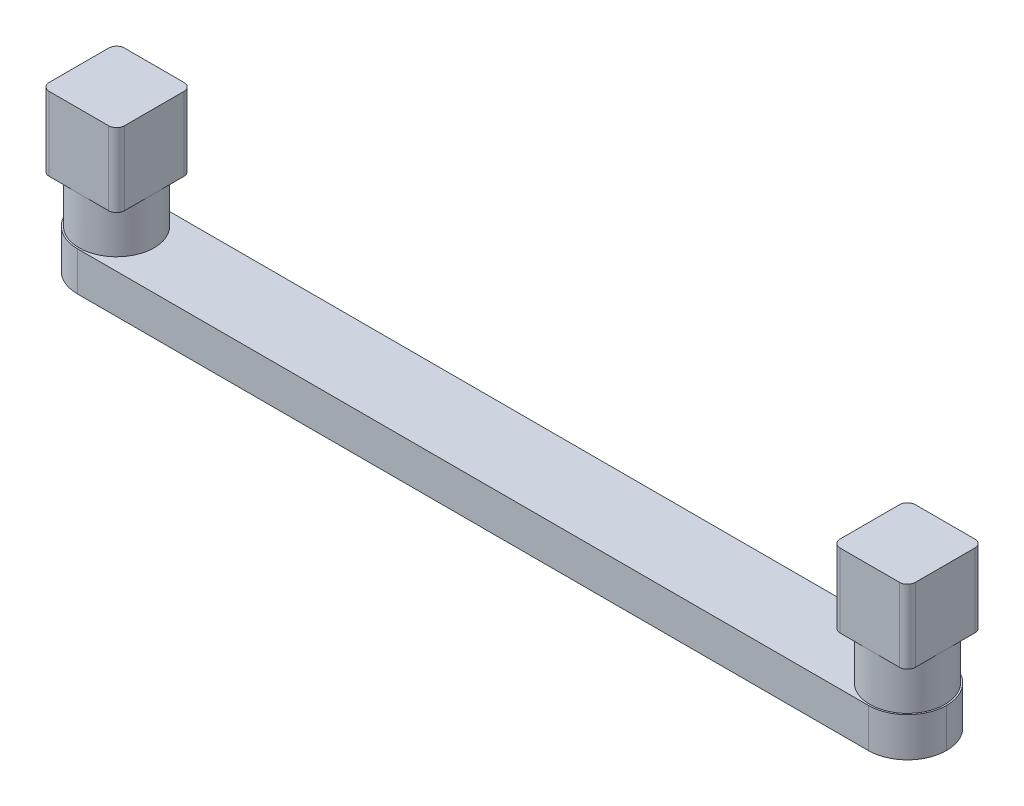
ISO-10303-21;
HEADER;
FILE_DESCRIPTION(('STEP AP214'),'2;1');
FILE_NAME('part.step','',(''),(''),'','','');
FILE_SCHEMA(('AUTOMOTIVE_DESIGN { 1 0 10303 214 1 1 1 1 }'));
ENDSEC;
DATA;
#1=APPLICATION_CONTEXT('core data for automotive mechanical design processes');
#2=APPLICATION_PROTOCOL_DEFINITION('international standard','automotive_design',2000,#1);
#3=PRODUCT_CONTEXT('',#1,'mechanical');
#4=PRODUCT('Part','Part','',(#3));
#5=PRODUCT_RELATED_PRODUCT_CATEGORY('part','',(#4));
#6=PRODUCT_DEFINITION_FORMATION('','',#4);
#7=PRODUCT_DEFINITION_CONTEXT('part definition',#1,'design');
#8=PRODUCT_DEFINITION('design','',#6,#7);
#9=PRODUCT_DEFINITION_SHAPE('','',#8);
#10=(LENGTH_UNIT() NAMED_UNIT(*) SI_UNIT(.MILLI.,.METRE.));
#11=(NAMED_UNIT(*) PLANE_ANGLE_UNIT() SI_UNIT($,.RADIAN.));
#12=(NAMED_UNIT(*) SI_UNIT($,.STERADIAN.) SOLID_ANGLE_UNIT());
#13=UNCERTAINTY_MEASURE_WITH_UNIT(LENGTH_MEASURE(1.E-05),#10,'distance_accuracy_value','');
#14=(GEOMETRIC_REPRESENTATION_CONTEXT(3) GLOBAL_UNCERTAINTY_ASSIGNED_CONTEXT((#13)) GLOBAL_UNIT_ASSIGNED_CONTEXT((#10,
#11,#12)) REPRESENTATION_CONTEXT('',''));
#15=CARTESIAN_POINT('',(0.,0.,0.));
#16=DIRECTION('',(0.,0.,1.));
#17=DIRECTION('',(1.,0.,0.));
#18=AXIS2_PLACEMENT_3D('',#15,#16,#17);
#19=CARTESIAN_POINT('',(-35.2425,3.175,-3.175));
#20=DIRECTION('',(0.,0.,1.));
#21=DIRECTION('',(1.,0.,0.));
#22=AXIS2_PLACEMENT_3D('',#19,#20,#21);
#23=PLANE('',#22);
#24=DIRECTION('',(-1.,0.,0.));
#25=VECTOR('',#24,1.);
#26=CARTESIAN_POINT('',(-35.2425,0.,-3.175));
#27=LINE('',#26,#25);
#28=CARTESIAN_POINT('',(32.0675,0.,-3.175));
#29=VERTEX_POINT('',#28);
#30=CARTESIAN_POINT('',(-32.0675,0.,-3.175));
#31=VERTEX_POINT('',#30);
#32=EDGE_CURVE('E281',#29,#31,#27,.T.);
#33=ORIENTED_EDGE('',*,*,#32,.T.);
#34=DIRECTION('',(0.,-1.,0.));
#35=VECTOR('',#34,1.);
#36=CARTESIAN_POINT('',(-32.0675,3.175,-3.175));
#37=LINE('',#36,#35);
#38=CARTESIAN_POINT('',(-32.0675,3.175,-3.175));
#39=VERTEX_POINT('',#38);
#40=EDGE_CURVE('E321',#31,#39,#37,.F.);
#41=ORIENTED_EDGE('',*,*,#40,.T.);
#42=DIRECTION('',(-1.,0.,0.));
#43=VECTOR('',#42,1.);
#44=CARTESIAN_POINT('',(-35.2425,3.175,-3.175));
#45=LINE('',#44,#43);
#46=CARTESIAN_POINT('',(32.0675,3.175,-3.175));
#47=VERTEX_POINT('',#46);
#48=EDGE_CURVE('E283',#47,#39,#45,.T.);
#49=ORIENTED_EDGE('',*,*,#48,.F.);
#50=DIRECTION('',(0.,-1.,0.));
#51=VECTOR('',#50,1.);
#52=CARTESIAN_POINT('',(32.0675,3.175,-3.175));
#53=LINE('',#52,#51);
#54=EDGE_CURVE('E319',#47,#29,#53,.T.);
#55=ORIENTED_EDGE('',*,*,#54,.T.);
#56=EDGE_LOOP('',(#33,#41,#49,#55));
#57=FACE_BOUND('',#56,.T.);
#58=ADVANCED_FACE('F35',(#57),#23,.F.);
#59=CARTESIAN_POINT('',(-35.2425,3.175,3.175));
#60=DIRECTION('',(0.,0.,-1.));
#61=DIRECTION('',(-1.,0.,0.));
#62=AXIS2_PLACEMENT_3D('',#59,#60,#61);
#63=PLANE('',#62);
#64=DIRECTION('',(1.,0.,0.));
#65=VECTOR('',#64,1.);
#66=CARTESIAN_POINT('',(-35.2425,3.175,3.175));
#67=LINE('',#66,#65);
#68=CARTESIAN_POINT('',(-32.0675,3.175,3.175));
#69=VERTEX_POINT('',#68);
#70=CARTESIAN_POINT('',(32.0675,3.175,3.175));
#71=VERTEX_POINT('',#70);
#72=EDGE_CURVE('E286',#69,#71,#67,.T.);
#73=ORIENTED_EDGE('',*,*,#72,.F.);
#74=DIRECTION('',(0.,-1.,0.));
#75=VECTOR('',#74,1.);
#76=CARTESIAN_POINT('',(-32.0675,3.175,3.175));
#77=LINE('',#76,#75);
#78=CARTESIAN_POINT('',(-32.0675,0.,3.175));
#79=VERTEX_POINT('',#78);
#80=EDGE_CURVE('E300',#69,#79,#77,.T.);
#81=ORIENTED_EDGE('',*,*,#80,.T.);
#82=DIRECTION('',(1.,0.,0.));
#83=VECTOR('',#82,1.);
#84=CARTESIAN_POINT('',(-35.2425,0.,3.175));
#85=LINE('',#84,#83);
#86=CARTESIAN_POINT('',(32.0675,0.,3.175));
#87=VERTEX_POINT('',#86);
#88=EDGE_CURVE('E287',#79,#87,#85,.T.);
#89=ORIENTED_EDGE('',*,*,#88,.T.);
#90=DIRECTION('',(0.,-1.,0.));
#91=VECTOR('',#90,1.);
#92=CARTESIAN_POINT('',(32.0675,3.175,3.175));
#93=LINE('',#92,#91);
#94=EDGE_CURVE('E297',#87,#71,#93,.F.);
#95=ORIENTED_EDGE('',*,*,#94,.T.);
#96=EDGE_LOOP('',(#73,#81,#89,#95));
#97=FACE_BOUND('',#96,.T.);
#98=ADVANCED_FACE('F449',(#97),#63,.F.);
#99=CARTESIAN_POINT('',(0.,3.175,0.));
#100=DIRECTION('',(0.,-1.,0.));
#101=DIRECTION('',(0.,0.,-1.));
#102=AXIS2_PLACEMENT_3D('',#99,#100,#101);
#103=PLANE('',#102);
#104=CARTESIAN_POINT('',(-32.0675,3.175,0.));
#105=DIRECTION('',(0.,-1.,0.));
#106=DIRECTION('',(0.,0.,1.));
#107=AXIS2_PLACEMENT_3D('',#104,#105,#106);
#108=CIRCLE('',#107,3.048);
#109=CARTESIAN_POINT('',(-32.0675,3.175,3.048));
#110=VERTEX_POINT('',#109);
#111=EDGE_CURVE('E244',#110,#110,#108,.T.);
#112=ORIENTED_EDGE('',*,*,#111,.T.);
#113=EDGE_LOOP('',(#112));
#114=FACE_BOUND('',#113,.T.);
#115=CARTESIAN_POINT('',(32.0675,3.175,0.));
#116=DIRECTION('',(0.,-1.,0.));
#117=DIRECTION('',(0.,0.,-1.));
#118=AXIS2_PLACEMENT_3D('',#115,#116,#117);
#119=CIRCLE('',#118,3.048);
#120=CARTESIAN_POINT('',(32.0675,3.175,-3.048));
#121=VERTEX_POINT('',#120);
#122=EDGE_CURVE('E290',#121,#121,#119,.F.);
#123=ORIENTED_EDGE('',*,*,#122,.F.);
#124=EDGE_LOOP('',(#123));
#125=FACE_BOUND('',#124,.T.);
#126=CARTESIAN_POINT('',(-32.0675,3.175,0.));
#127=DIRECTION('',(0.,-1.,0.));
#128=DIRECTION('',(0.,0.,-1.));
#129=AXIS2_PLACEMENT_3D('',#126,#127,#128);
#130=CIRCLE('',#129,3.175);
#131=CARTESIAN_POINT('',(-35.2425,3.175,0.));
#132=VERTEX_POINT('',#131);
#133=EDGE_CURVE('E315',#39,#132,#130,.F.);
#134=ORIENTED_EDGE('',*,*,#133,.T.);
#135=CARTESIAN_POINT('',(-32.0675,3.175,0.));
#136=DIRECTION('',(0.,-1.,0.));
#137=DIRECTION('',(0.,0.,-1.));
#138=AXIS2_PLACEMENT_3D('',#135,#136,#137);
#139=CIRCLE('',#138,3.175);
#140=EDGE_CURVE('E317',#132,#69,#139,.F.);
#141=ORIENTED_EDGE('',*,*,#140,.T.);
#142=ORIENTED_EDGE('',*,*,#72,.T.);
#143=CARTESIAN_POINT('',(32.0675,3.175,0.));
#144=DIRECTION('',(0.,-1.,0.));
#145=DIRECTION('',(0.,0.,-1.));
#146=AXIS2_PLACEMENT_3D('',#143,#144,#145);
#147=CIRCLE('',#146,3.175);
#148=CARTESIAN_POINT('',(35.2425,3.175,0.));
#149=VERTEX_POINT('',#148);
#150=EDGE_CURVE('E313',#71,#149,#147,.F.);
#151=ORIENTED_EDGE('',*,*,#150,.T.);
#152=CARTESIAN_POINT('',(32.0675,3.175,0.));
#153=DIRECTION('',(0.,-1.,0.));
#154=DIRECTION('',(0.,0.,-1.));
#155=AXIS2_PLACEMENT_3D('',#152,#153,#154);
#156=CIRCLE('',#155,3.175);
#157=EDGE_CURVE('E311',#149,#47,#156,.F.);
#158=ORIENTED_EDGE('',*,*,#157,.T.);
#159=ORIENTED_EDGE('',*,*,#48,.T.);
#160=EDGE_LOOP('',(#134,#141,#142,#151,#158,#159));
#161=FACE_BOUND('',#160,.T.);
#162=ADVANCED_FACE('F455',(#114,#125,#161),#103,.F.);
#163=CARTESIAN_POINT('',(0.,0.,0.));
#164=DIRECTION('',(0.,-1.,0.));
#165=DIRECTION('',(0.,0.,-1.));
#166=AXIS2_PLACEMENT_3D('',#163,#164,#165);
#167=PLANE('',#166);
#168=ORIENTED_EDGE('',*,*,#88,.F.);
#169=CARTESIAN_POINT('',(-32.0675,0.,0.));
#170=DIRECTION('',(0.,-1.,0.));
#171=DIRECTION('',(0.,0.,-1.));
#172=AXIS2_PLACEMENT_3D('',#169,#170,#171);
#173=CIRCLE('',#172,3.175);
#174=CARTESIAN_POINT('',(-35.2425,0.,0.));
#175=VERTEX_POINT('',#174);
#176=EDGE_CURVE('E309',#79,#175,#173,.T.);
#177=ORIENTED_EDGE('',*,*,#176,.T.);
#178=CARTESIAN_POINT('',(-32.0675,0.,0.));
#179=DIRECTION('',(0.,-1.,0.));
#180=DIRECTION('',(0.,0.,-1.));
#181=AXIS2_PLACEMENT_3D('',#178,#179,#180);
#182=CIRCLE('',#181,3.175);
#183=EDGE_CURVE('E307',#175,#31,#182,.T.);
#184=ORIENTED_EDGE('',*,*,#183,.T.);
#185=ORIENTED_EDGE('',*,*,#32,.F.);
#186=CARTESIAN_POINT('',(32.0675,0.,0.));
#187=DIRECTION('',(0.,-1.,0.));
#188=DIRECTION('',(0.,0.,-1.));
#189=AXIS2_PLACEMENT_3D('',#186,#187,#188);
#190=CIRCLE('',#189,3.175);
#191=CARTESIAN_POINT('',(35.2425,0.,0.));
#192=VERTEX_POINT('',#191);
#193=EDGE_CURVE('E303',#29,#192,#190,.T.);
#194=ORIENTED_EDGE('',*,*,#193,.T.);
#195=CARTESIAN_POINT('',(32.0675,0.,0.));
#196=DIRECTION('',(0.,-1.,0.));
#197=DIRECTION('',(0.,0.,-1.));
#198=AXIS2_PLACEMENT_3D('',#195,#196,#197);
#199=CIRCLE('',#198,3.175);
#200=EDGE_CURVE('E305',#192,#87,#199,.T.);
#201=ORIENTED_EDGE('',*,*,#200,.T.);
#202=EDGE_LOOP('',(#168,#177,#184,#185,#194,#201));
#203=FACE_BOUND('',#202,.T.);
#204=ADVANCED_FACE('F595',(#203),#167,.T.);
#205=CARTESIAN_POINT('',(32.0675,6.985,0.));
#206=DIRECTION('',(0.,-1.,0.));
#207=DIRECTION('',(0.,0.,-1.));
#208=AXIS2_PLACEMENT_3D('',#205,#206,#207);
#209=CYLINDRICAL_SURFACE('',#208,3.048);
#210=CARTESIAN_POINT('',(32.0675,6.985,0.));
#211=DIRECTION('',(0.,1.,0.));
#212=DIRECTION('',(0.,0.,1.));
#213=AXIS2_PLACEMENT_3D('',#210,#211,#212);
#214=CIRCLE('',#213,3.048);
#215=CARTESIAN_POINT('',(32.0675,6.985,3.048));
#216=VERTEX_POINT('',#215);
#217=CARTESIAN_POINT('',(35.1155,6.985,0.));
#218=VERTEX_POINT('',#217);
#219=EDGE_CURVE('E278',#216,#218,#214,.T.);
#220=ORIENTED_EDGE('',*,*,#219,.F.);
#221=CARTESIAN_POINT('',(29.0195,6.985,0.));
#222=VERTEX_POINT('',#221);
#223=EDGE_CURVE('E266',#222,#216,#214,.T.);
#224=ORIENTED_EDGE('',*,*,#223,.F.);
#225=CARTESIAN_POINT('',(32.0675,6.985,-3.048));
#226=VERTEX_POINT('',#225);
#227=EDGE_CURVE('E793',#226,#222,#214,.T.);
#228=ORIENTED_EDGE('',*,*,#227,.F.);
#229=EDGE_CURVE('E282',#218,#226,#214,.T.);
#230=ORIENTED_EDGE('',*,*,#229,.F.);
#231=EDGE_LOOP('',(#220,#224,#228,#230));
#232=FACE_BOUND('',#231,.T.);
#233=ORIENTED_EDGE('',*,*,#122,.T.);
#234=EDGE_LOOP('',(#233));
#235=FACE_BOUND('',#234,.T.);
#236=ADVANCED_FACE('F710',(#232,#235),#209,.T.);
#237=CARTESIAN_POINT('',(0.,6.985,0.));
#238=DIRECTION('',(0.,-1.,0.));
#239=DIRECTION('',(0.,0.,-1.));
#240=AXIS2_PLACEMENT_3D('',#237,#238,#239);
#241=PLANE('',#240);
#242=DIRECTION('',(0.,0.,-1.));
#243=VECTOR('',#242,1.);
#244=CARTESIAN_POINT('',(35.1155,6.985,3.048));
#245=LINE('',#244,#243);
#246=CARTESIAN_POINT('',(35.1155,6.985,2.413));
#247=VERTEX_POINT('',#246);
#248=EDGE_CURVE('E267',#247,#218,#245,.T.);
#249=ORIENTED_EDGE('',*,*,#248,.F.);
#250=CARTESIAN_POINT('',(34.4805,6.985,2.413));
#251=DIRECTION('',(0.,-1.,0.));
#252=DIRECTION('',(0.,0.,-1.));
#253=AXIS2_PLACEMENT_3D('',#250,#251,#252);
#254=CIRCLE('',#253,0.635);
#255=CARTESIAN_POINT('',(34.4805,6.985,3.048));
#256=VERTEX_POINT('',#255);
#257=EDGE_CURVE('E330',#247,#256,#254,.T.);
#258=ORIENTED_EDGE('',*,*,#257,.T.);
#259=DIRECTION('',(1.,0.,0.));
#260=VECTOR('',#259,1.);
#261=CARTESIAN_POINT('',(29.0195,6.985,3.048));
#262=LINE('',#261,#260);
#263=EDGE_CURVE('E276',#216,#256,#262,.T.);
#264=ORIENTED_EDGE('',*,*,#263,.F.);
#265=ORIENTED_EDGE('',*,*,#219,.T.);
#266=EDGE_LOOP('',(#249,#258,#264,#265));
#267=FACE_BOUND('',#266,.T.);
#268=ADVANCED_FACE('F634',(#267),#241,.T.);
#269=DIRECTION('',(-1.,0.,0.));
#270=VECTOR('',#269,1.);
#271=CARTESIAN_POINT('',(29.0195,6.985,-3.048));
#272=LINE('',#271,#270);
#273=CARTESIAN_POINT('',(34.4805,6.985,-3.048));
#274=VERTEX_POINT('',#273);
#275=EDGE_CURVE('E271',#274,#226,#272,.T.);
#276=ORIENTED_EDGE('',*,*,#275,.F.);
#277=CARTESIAN_POINT('',(34.4805,6.985,-2.413));
#278=DIRECTION('',(0.,-1.,0.));
#279=DIRECTION('',(0.,0.,-1.));
#280=AXIS2_PLACEMENT_3D('',#277,#278,#279);
#281=CIRCLE('',#280,0.635);
#282=CARTESIAN_POINT('',(35.1155,6.985,-2.413));
#283=VERTEX_POINT('',#282);
#284=EDGE_CURVE('E359',#274,#283,#281,.T.);
#285=ORIENTED_EDGE('',*,*,#284,.T.);
#286=EDGE_CURVE('E270',#218,#283,#245,.T.);
#287=ORIENTED_EDGE('',*,*,#286,.F.);
#288=ORIENTED_EDGE('',*,*,#229,.T.);
#289=EDGE_LOOP('',(#276,#285,#287,#288));
#290=FACE_BOUND('',#289,.T.);
#291=ADVANCED_FACE('F693',(#290),#241,.T.);
#292=DIRECTION('',(0.,0.,1.));
#293=VECTOR('',#292,1.);
#294=CARTESIAN_POINT('',(29.0195,6.985,3.048));
#295=LINE('',#294,#293);
#296=CARTESIAN_POINT('',(29.0195,6.985,-2.413));
#297=VERTEX_POINT('',#296);
#298=EDGE_CURVE('E274',#297,#222,#295,.T.);
#299=ORIENTED_EDGE('',*,*,#298,.F.);
#300=CARTESIAN_POINT('',(29.6545,6.985,-2.413));
#301=DIRECTION('',(0.,-1.,0.));
#302=DIRECTION('',(0.,0.,-1.));
#303=AXIS2_PLACEMENT_3D('',#300,#301,#302);
#304=CIRCLE('',#303,0.635);
#305=CARTESIAN_POINT('',(29.6545,6.985,-3.048));
#306=VERTEX_POINT('',#305);
#307=EDGE_CURVE('E352',#297,#306,#304,.T.);
#308=ORIENTED_EDGE('',*,*,#307,.T.);
#309=EDGE_CURVE('E269',#226,#306,#272,.T.);
#310=ORIENTED_EDGE('',*,*,#309,.F.);
#311=ORIENTED_EDGE('',*,*,#227,.T.);
#312=EDGE_LOOP('',(#299,#308,#310,#311));
#313=FACE_BOUND('',#312,.T.);
#314=ADVANCED_FACE('F635',(#313),#241,.T.);
#315=CARTESIAN_POINT('',(35.1155,12.954,3.048));
#316=DIRECTION('',(-1.,0.,0.));
#317=DIRECTION('',(0.,0.,1.));
#318=AXIS2_PLACEMENT_3D('',#315,#316,#317);
#319=PLANE('',#318);
#320=DIRECTION('',(0.,0.,-1.));
#321=VECTOR('',#320,1.);
#322=CARTESIAN_POINT('',(35.1155,12.954,3.048));
#323=LINE('',#322,#321);
#324=CARTESIAN_POINT('',(35.1155,12.954,2.413));
#325=VERTEX_POINT('',#324);
#326=CARTESIAN_POINT('',(35.1155,12.954,-2.413));
#327=VERTEX_POINT('',#326);
#328=EDGE_CURVE('E253',#325,#327,#323,.T.);
#329=ORIENTED_EDGE('',*,*,#328,.F.);
#330=DIRECTION('',(0.,-1.,0.));
#331=VECTOR('',#330,1.);
#332=CARTESIAN_POINT('',(35.1155,12.954,2.413));
#333=LINE('',#332,#331);
#334=EDGE_CURVE('E327',#325,#247,#333,.T.);
#335=ORIENTED_EDGE('',*,*,#334,.T.);
#336=ORIENTED_EDGE('',*,*,#248,.T.);
#337=ORIENTED_EDGE('',*,*,#286,.T.);
#338=DIRECTION('',(0.,-1.,0.));
#339=VECTOR('',#338,1.);
#340=CARTESIAN_POINT('',(35.1155,12.954,-2.413));
#341=LINE('',#340,#339);
#342=EDGE_CURVE('E323',#283,#327,#341,.F.);
#343=ORIENTED_EDGE('',*,*,#342,.T.);
#344=EDGE_LOOP('',(#329,#335,#336,#337,#343));
#345=FACE_BOUND('',#344,.T.);
#346=ADVANCED_FACE('F674',(#345),#319,.F.);
#347=CARTESIAN_POINT('',(29.0195,12.954,-3.048));
#348=DIRECTION('',(0.,0.,1.));
#349=DIRECTION('',(1.,0.,0.));
#350=AXIS2_PLACEMENT_3D('',#347,#348,#349);
#351=PLANE('',#350);
#352=ORIENTED_EDGE('',*,*,#309,.T.);
#353=DIRECTION('',(0.,-1.,0.));
#354=VECTOR('',#353,1.);
#355=CARTESIAN_POINT('',(29.6545,12.954,-3.048));
#356=LINE('',#355,#354);
#357=CARTESIAN_POINT('',(29.6545,12.954,-3.048));
#358=VERTEX_POINT('',#357);
#359=EDGE_CURVE('E357',#306,#358,#356,.F.);
#360=ORIENTED_EDGE('',*,*,#359,.T.);
#361=DIRECTION('',(-1.,0.,0.));
#362=VECTOR('',#361,1.);
#363=CARTESIAN_POINT('',(29.0195,12.954,-3.048));
#364=LINE('',#363,#362);
#365=CARTESIAN_POINT('',(34.4805,12.954,-3.048));
#366=VERTEX_POINT('',#365);
#367=EDGE_CURVE('E256',#366,#358,#364,.T.);
#368=ORIENTED_EDGE('',*,*,#367,.F.);
#369=DIRECTION('',(0.,-1.,0.));
#370=VECTOR('',#369,1.);
#371=CARTESIAN_POINT('',(34.4805,12.954,-3.048));
#372=LINE('',#371,#370);
#373=EDGE_CURVE('E354',#366,#274,#372,.T.);
#374=ORIENTED_EDGE('',*,*,#373,.T.);
#375=ORIENTED_EDGE('',*,*,#275,.T.);
#376=EDGE_LOOP('',(#352,#360,#368,#374,#375));
#377=FACE_BOUND('',#376,.T.);
#378=ADVANCED_FACE('F664',(#377),#351,.F.);
#379=CARTESIAN_POINT('',(29.0195,12.954,3.048));
#380=DIRECTION('',(1.,0.,0.));
#381=DIRECTION('',(0.,0.,-1.));
#382=AXIS2_PLACEMENT_3D('',#379,#380,#381);
#383=PLANE('',#382);
#384=CARTESIAN_POINT('',(29.0195,6.985,2.413));
#385=VERTEX_POINT('',#384);
#386=EDGE_CURVE('E273',#222,#385,#295,.T.);
#387=ORIENTED_EDGE('',*,*,#386,.T.);
#388=DIRECTION('',(0.,-1.,0.));
#389=VECTOR('',#388,1.);
#390=CARTESIAN_POINT('',(29.0195,12.954,2.413));
#391=LINE('',#390,#389);
#392=CARTESIAN_POINT('',(29.0195,12.954,2.413));
#393=VERTEX_POINT('',#392);
#394=EDGE_CURVE('E350',#385,#393,#391,.F.);
#395=ORIENTED_EDGE('',*,*,#394,.T.);
#396=DIRECTION('',(0.,0.,1.));
#397=VECTOR('',#396,1.);
#398=CARTESIAN_POINT('',(29.0195,12.954,3.048));
#399=LINE('',#398,#397);
#400=CARTESIAN_POINT('',(29.0195,12.954,-2.413));
#401=VERTEX_POINT('',#400);
#402=EDGE_CURVE('E260',#401,#393,#399,.T.);
#403=ORIENTED_EDGE('',*,*,#402,.F.);
#404=DIRECTION('',(0.,-1.,0.));
#405=VECTOR('',#404,1.);
#406=CARTESIAN_POINT('',(29.0195,12.954,-2.413));
#407=LINE('',#406,#405);
#408=EDGE_CURVE('E347',#401,#297,#407,.T.);
#409=ORIENTED_EDGE('',*,*,#408,.T.);
#410=ORIENTED_EDGE('',*,*,#298,.T.);
#411=EDGE_LOOP('',(#387,#395,#403,#409,#410));
#412=FACE_BOUND('',#411,.T.);
#413=ADVANCED_FACE('F654',(#412),#383,.F.);
#414=CARTESIAN_POINT('',(29.0195,12.954,3.048));
#415=DIRECTION('',(0.,0.,-1.));
#416=DIRECTION('',(-1.,0.,0.));
#417=AXIS2_PLACEMENT_3D('',#414,#415,#416);
#418=PLANE('',#417);
#419=ORIENTED_EDGE('',*,*,#263,.T.);
#420=DIRECTION('',(0.,-1.,0.));
#421=VECTOR('',#420,1.);
#422=CARTESIAN_POINT('',(34.4805,12.954,3.048));
#423=LINE('',#422,#421);
#424=CARTESIAN_POINT('',(34.4805,12.954,3.048));
#425=VERTEX_POINT('',#424);
#426=EDGE_CURVE('E335',#256,#425,#423,.F.);
#427=ORIENTED_EDGE('',*,*,#426,.T.);
#428=DIRECTION('',(1.,0.,0.));
#429=VECTOR('',#428,1.);
#430=CARTESIAN_POINT('',(29.0195,12.954,3.048));
#431=LINE('',#430,#429);
#432=CARTESIAN_POINT('',(29.6545,12.954,3.048));
#433=VERTEX_POINT('',#432);
#434=EDGE_CURVE('E263',#433,#425,#431,.T.);
#435=ORIENTED_EDGE('',*,*,#434,.F.);
#436=DIRECTION('',(0.,-1.,0.));
#437=VECTOR('',#436,1.);
#438=CARTESIAN_POINT('',(29.6545,12.954,3.048));
#439=LINE('',#438,#437);
#440=CARTESIAN_POINT('',(29.6545,6.985,3.048));
#441=VERTEX_POINT('',#440);
#442=EDGE_CURVE('E332',#433,#441,#439,.T.);
#443=ORIENTED_EDGE('',*,*,#442,.T.);
#444=EDGE_CURVE('E257',#441,#216,#262,.T.);
#445=ORIENTED_EDGE('',*,*,#444,.T.);
#446=EDGE_LOOP('',(#419,#427,#435,#443,#445));
#447=FACE_BOUND('',#446,.T.);
#448=ADVANCED_FACE('F644',(#447),#418,.F.);
#449=CARTESIAN_POINT('',(0.,12.954,0.));
#450=DIRECTION('',(0.,-1.,0.));
#451=DIRECTION('',(0.,0.,-1.));
#452=AXIS2_PLACEMENT_3D('',#449,#450,#451);
#453=PLANE('',#452);
#454=ORIENTED_EDGE('',*,*,#434,.T.);
#455=CARTESIAN_POINT('',(34.4805,12.954,2.413));
#456=DIRECTION('',(0.,-1.,0.));
#457=DIRECTION('',(0.,0.,-1.));
#458=AXIS2_PLACEMENT_3D('',#455,#456,#457);
#459=CIRCLE('',#458,0.635);
#460=EDGE_CURVE('E343',#425,#325,#459,.F.);
#461=ORIENTED_EDGE('',*,*,#460,.T.);
#462=ORIENTED_EDGE('',*,*,#328,.T.);
#463=CARTESIAN_POINT('',(34.4805,12.954,-2.413));
#464=DIRECTION('',(0.,-1.,0.));
#465=DIRECTION('',(0.,0.,-1.));
#466=AXIS2_PLACEMENT_3D('',#463,#464,#465);
#467=CIRCLE('',#466,0.635);
#468=EDGE_CURVE('E337',#327,#366,#467,.F.);
#469=ORIENTED_EDGE('',*,*,#468,.T.);
#470=ORIENTED_EDGE('',*,*,#367,.T.);
#471=CARTESIAN_POINT('',(29.6545,12.954,-2.413));
#472=DIRECTION('',(0.,-1.,0.));
#473=DIRECTION('',(0.,0.,-1.));
#474=AXIS2_PLACEMENT_3D('',#471,#472,#473);
#475=CIRCLE('',#474,0.635);
#476=EDGE_CURVE('E339',#358,#401,#475,.F.);
#477=ORIENTED_EDGE('',*,*,#476,.T.);
#478=ORIENTED_EDGE('',*,*,#402,.T.);
#479=CARTESIAN_POINT('',(29.6545,12.954,2.413));
#480=DIRECTION('',(0.,-1.,0.));
#481=DIRECTION('',(0.,0.,-1.));
#482=AXIS2_PLACEMENT_3D('',#479,#480,#481);
#483=CIRCLE('',#482,0.635);
#484=EDGE_CURVE('E341',#393,#433,#483,.F.);
#485=ORIENTED_EDGE('',*,*,#484,.T.);
#486=EDGE_LOOP('',(#454,#461,#462,#469,#470,#477,#478,#485));
#487=FACE_BOUND('',#486,.T.);
#488=ADVANCED_FACE('F631',(#487),#453,.F.);
#489=ORIENTED_EDGE('',*,*,#444,.F.);
#490=CARTESIAN_POINT('',(29.6545,6.985,2.413));
#491=DIRECTION('',(0.,-1.,0.));
#492=DIRECTION('',(0.,0.,-1.));
#493=AXIS2_PLACEMENT_3D('',#490,#491,#492);
#494=CIRCLE('',#493,0.635);
#495=EDGE_CURVE('E345',#441,#385,#494,.T.);
#496=ORIENTED_EDGE('',*,*,#495,.T.);
#497=ORIENTED_EDGE('',*,*,#386,.F.);
#498=ORIENTED_EDGE('',*,*,#223,.T.);
#499=EDGE_LOOP('',(#489,#496,#497,#498));
#500=FACE_BOUND('',#499,.T.);
#501=ADVANCED_FACE('F468',(#500),#241,.T.);
#502=CARTESIAN_POINT('',(-32.0675,3.175,0.));
#503=DIRECTION('',(0.,-1.,0.));
#504=DIRECTION('',(0.,0.,-1.));
#505=AXIS2_PLACEMENT_3D('',#502,#503,#504);
#506=CYLINDRICAL_SURFACE('',#505,3.175);
#507=DIRECTION('',(0.,-1.,0.));
#508=VECTOR('',#507,1.);
#509=CARTESIAN_POINT('',(-35.2425,3.175,0.));
#510=LINE('',#509,#508);
#511=EDGE_CURVE('E240',#132,#175,#510,.T.);
#512=ORIENTED_EDGE('',*,*,#511,.F.);
#513=ORIENTED_EDGE('',*,*,#133,.F.);
#514=ORIENTED_EDGE('',*,*,#40,.F.);
#515=ORIENTED_EDGE('',*,*,#183,.F.);
#516=EDGE_LOOP('',(#512,#513,#514,#515));
#517=FACE_BOUND('',#516,.T.);
#518=ADVANCED_FACE('F464',(#517),#506,.T.);
#519=CARTESIAN_POINT('',(-32.0675,3.175,0.));
#520=DIRECTION('',(0.,-1.,0.));
#521=DIRECTION('',(0.,0.,-1.));
#522=AXIS2_PLACEMENT_3D('',#519,#520,#521);
#523=CYLINDRICAL_SURFACE('',#522,3.175);
#524=ORIENTED_EDGE('',*,*,#140,.F.);
#525=ORIENTED_EDGE('',*,*,#511,.T.);
#526=ORIENTED_EDGE('',*,*,#176,.F.);
#527=ORIENTED_EDGE('',*,*,#80,.F.);
#528=EDGE_LOOP('',(#524,#525,#526,#527));
#529=FACE_BOUND('',#528,.T.);
#530=ADVANCED_FACE('F460',(#529),#523,.T.);
#531=CARTESIAN_POINT('',(32.0675,3.175,0.));
#532=DIRECTION('',(0.,-1.,0.));
#533=DIRECTION('',(0.,0.,-1.));
#534=AXIS2_PLACEMENT_3D('',#531,#532,#533);
#535=CYLINDRICAL_SURFACE('',#534,3.175);
#536=ORIENTED_EDGE('',*,*,#54,.F.);
#537=ORIENTED_EDGE('',*,*,#157,.F.);
#538=DIRECTION('',(0.,-1.,0.));
#539=VECTOR('',#538,1.);
#540=CARTESIAN_POINT('',(35.2425,3.175,0.));
#541=LINE('',#540,#539);
#542=EDGE_CURVE('E238',#192,#149,#541,.F.);
#543=ORIENTED_EDGE('',*,*,#542,.F.);
#544=ORIENTED_EDGE('',*,*,#193,.F.);
#545=EDGE_LOOP('',(#536,#537,#543,#544));
#546=FACE_BOUND('',#545,.T.);
#547=ADVANCED_FACE('F463',(#546),#535,.T.);
#548=CARTESIAN_POINT('',(32.0675,3.175,0.));
#549=DIRECTION('',(0.,-1.,0.));
#550=DIRECTION('',(0.,0.,-1.));
#551=AXIS2_PLACEMENT_3D('',#548,#549,#550);
#552=CYLINDRICAL_SURFACE('',#551,3.175);
#553=ORIENTED_EDGE('',*,*,#150,.F.);
#554=ORIENTED_EDGE('',*,*,#94,.F.);
#555=ORIENTED_EDGE('',*,*,#200,.F.);
#556=ORIENTED_EDGE('',*,*,#542,.T.);
#557=EDGE_LOOP('',(#553,#554,#555,#556));
#558=FACE_BOUND('',#557,.T.);
#559=ADVANCED_FACE('F470',(#558),#552,.T.);
#560=CARTESIAN_POINT('',(34.4805,12.954,2.413));
#561=DIRECTION('',(0.,-1.,0.));
#562=DIRECTION('',(0.,0.,-1.));
#563=AXIS2_PLACEMENT_3D('',#560,#561,#562);
#564=CYLINDRICAL_SURFACE('',#563,0.635);
#565=ORIENTED_EDGE('',*,*,#460,.F.);
#566=ORIENTED_EDGE('',*,*,#426,.F.);
#567=ORIENTED_EDGE('',*,*,#257,.F.);
#568=ORIENTED_EDGE('',*,*,#334,.F.);
#569=EDGE_LOOP('',(#565,#566,#567,#568));
#570=FACE_BOUND('',#569,.T.);
#571=ADVANCED_FACE('F473',(#570),#564,.T.);
#572=CARTESIAN_POINT('',(29.6545,12.954,2.413));
#573=DIRECTION('',(0.,-1.,0.));
#574=DIRECTION('',(0.,0.,-1.));
#575=AXIS2_PLACEMENT_3D('',#572,#573,#574);
#576=CYLINDRICAL_SURFACE('',#575,0.635);
#577=ORIENTED_EDGE('',*,*,#484,.F.);
#578=ORIENTED_EDGE('',*,*,#394,.F.);
#579=ORIENTED_EDGE('',*,*,#495,.F.);
#580=ORIENTED_EDGE('',*,*,#442,.F.);
#581=EDGE_LOOP('',(#577,#578,#579,#580));
#582=FACE_BOUND('',#581,.T.);
#583=ADVANCED_FACE('F480',(#582),#576,.T.);
#584=CARTESIAN_POINT('',(29.6545,12.954,-2.413));
#585=DIRECTION('',(0.,-1.,0.));
#586=DIRECTION('',(0.,0.,-1.));
#587=AXIS2_PLACEMENT_3D('',#584,#585,#586);
#588=CYLINDRICAL_SURFACE('',#587,0.635);
#589=ORIENTED_EDGE('',*,*,#476,.F.);
#590=ORIENTED_EDGE('',*,*,#359,.F.);
#591=ORIENTED_EDGE('',*,*,#307,.F.);
#592=ORIENTED_EDGE('',*,*,#408,.F.);
#593=EDGE_LOOP('',(#589,#590,#591,#592));
#594=FACE_BOUND('',#593,.T.);
#595=ADVANCED_FACE('F484',(#594),#588,.T.);
#596=CARTESIAN_POINT('',(34.4805,12.954,-2.413));
#597=DIRECTION('',(0.,-1.,0.));
#598=DIRECTION('',(0.,0.,-1.));
#599=AXIS2_PLACEMENT_3D('',#596,#597,#598);
#600=CYLINDRICAL_SURFACE('',#599,0.635);
#601=ORIENTED_EDGE('',*,*,#468,.F.);
#602=ORIENTED_EDGE('',*,*,#342,.F.);
#603=ORIENTED_EDGE('',*,*,#284,.F.);
#604=ORIENTED_EDGE('',*,*,#373,.F.);
#605=EDGE_LOOP('',(#601,#602,#603,#604));
#606=FACE_BOUND('',#605,.T.);
#607=ADVANCED_FACE('F488',(#606),#600,.T.);
#608=CARTESIAN_POINT('',(-32.0675,6.985,0.));
#609=DIRECTION('',(0.,-1.,0.));
#610=DIRECTION('',(0.,0.,-1.));
#611=AXIS2_PLACEMENT_3D('',#608,#609,#610);
#612=CYLINDRICAL_SURFACE('',#611,3.048);
#613=CARTESIAN_POINT('',(-32.0675,6.985,0.));
#614=DIRECTION('',(0.,-1.,0.));
#615=DIRECTION('',(0.,0.,1.));
#616=AXIS2_PLACEMENT_3D('',#613,#614,#615);
#617=CIRCLE('',#616,3.048);
#618=CARTESIAN_POINT('',(-32.0675,6.985,3.048));
#619=VERTEX_POINT('',#618);
#620=CARTESIAN_POINT('',(-35.1155,6.985,0.));
#621=VERTEX_POINT('',#620);
#622=EDGE_CURVE('E211',#619,#621,#617,.T.);
#623=ORIENTED_EDGE('',*,*,#622,.T.);
#624=CARTESIAN_POINT('',(-32.0675,6.985,-3.048));
#625=VERTEX_POINT('',#624);
#626=EDGE_CURVE('E221',#621,#625,#617,.T.);
#627=ORIENTED_EDGE('',*,*,#626,.T.);
#628=CARTESIAN_POINT('',(-29.0195,6.985,0.));
#629=VERTEX_POINT('',#628);
#630=EDGE_CURVE('E227',#625,#629,#617,.T.);
#631=ORIENTED_EDGE('',*,*,#630,.T.);
#632=EDGE_CURVE('E237',#629,#619,#617,.T.);
#633=ORIENTED_EDGE('',*,*,#632,.T.);
#634=EDGE_LOOP('',(#623,#627,#631,#633));
#635=FACE_BOUND('',#634,.T.);
#636=ORIENTED_EDGE('',*,*,#111,.F.);
#637=EDGE_LOOP('',(#636));
#638=FACE_BOUND('',#637,.T.);
#639=ADVANCED_FACE('F234',(#635,#638),#612,.T.);
#640=CARTESIAN_POINT('',(0.,6.985,0.));
#641=DIRECTION('',(0.,-1.,0.));
#642=DIRECTION('',(0.,0.,-1.));
#643=AXIS2_PLACEMENT_3D('',#640,#641,#642);
#644=PLANE('',#643);
#645=DIRECTION('',(-1.,0.,0.));
#646=VECTOR('',#645,1.);
#647=CARTESIAN_POINT('',(-29.0195,6.985,3.048));
#648=LINE('',#647,#646);
#649=CARTESIAN_POINT('',(-34.4805,6.985,3.048));
#650=VERTEX_POINT('',#649);
#651=EDGE_CURVE('E217',#619,#650,#648,.T.);
#652=ORIENTED_EDGE('',*,*,#651,.T.);
#653=CARTESIAN_POINT('',(-34.4805,6.985,2.413));
#654=DIRECTION('',(0.,-1.,0.));
#655=DIRECTION('',(0.,0.,-1.));
#656=AXIS2_PLACEMENT_3D('',#653,#654,#655);
#657=CIRCLE('',#656,0.635);
#658=CARTESIAN_POINT('',(-35.1155,6.985,2.413));
#659=VERTEX_POINT('',#658);
#660=EDGE_CURVE('E213',#650,#659,#657,.T.);
#661=ORIENTED_EDGE('',*,*,#660,.T.);
#662=DIRECTION('',(0.,0.,-1.));
#663=VECTOR('',#662,1.);
#664=CARTESIAN_POINT('',(-35.1155,6.985,3.048));
#665=LINE('',#664,#663);
#666=EDGE_CURVE('E206',#659,#621,#665,.T.);
#667=ORIENTED_EDGE('',*,*,#666,.T.);
#668=ORIENTED_EDGE('',*,*,#622,.F.);
#669=EDGE_LOOP('',(#652,#661,#667,#668));
#670=FACE_BOUND('',#669,.T.);
#671=ADVANCED_FACE('F209',(#670),#644,.T.);
#672=CARTESIAN_POINT('',(-35.1155,6.985,-2.413));
#673=VERTEX_POINT('',#672);
#674=EDGE_CURVE('E218',#621,#673,#665,.T.);
#675=ORIENTED_EDGE('',*,*,#674,.T.);
#676=CARTESIAN_POINT('',(-34.4805,6.985,-2.413));
#677=DIRECTION('',(0.,-1.,0.));
#678=DIRECTION('',(0.,0.,-1.));
#679=AXIS2_PLACEMENT_3D('',#676,#677,#678);
#680=CIRCLE('',#679,0.635);
#681=CARTESIAN_POINT('',(-34.4805,6.985,-3.048));
#682=VERTEX_POINT('',#681);
#683=EDGE_CURVE('E11',#673,#682,#680,.T.);
#684=ORIENTED_EDGE('',*,*,#683,.T.);
#685=DIRECTION('',(1.,0.,0.));
#686=VECTOR('',#685,1.);
#687=CARTESIAN_POINT('',(-29.0195,6.985,-3.048));
#688=LINE('',#687,#686);
#689=EDGE_CURVE('E223',#682,#625,#688,.T.);
#690=ORIENTED_EDGE('',*,*,#689,.T.);
#691=ORIENTED_EDGE('',*,*,#626,.F.);
#692=EDGE_LOOP('',(#675,#684,#690,#691));
#693=FACE_BOUND('',#692,.T.);
#694=ADVANCED_FACE('F222',(#693),#644,.T.);
#695=CARTESIAN_POINT('',(-29.6545,6.985,-3.048));
#696=VERTEX_POINT('',#695);
#697=EDGE_CURVE('E394',#625,#696,#688,.T.);
#698=ORIENTED_EDGE('',*,*,#697,.T.);
#699=CARTESIAN_POINT('',(-29.6545,6.985,-2.413));
#700=DIRECTION('',(0.,-1.,0.));
#701=DIRECTION('',(0.,0.,-1.));
#702=AXIS2_PLACEMENT_3D('',#699,#700,#701);
#703=CIRCLE('',#702,0.635);
#704=CARTESIAN_POINT('',(-29.0195,6.985,-2.413));
#705=VERTEX_POINT('',#704);
#706=EDGE_CURVE('E43',#696,#705,#703,.T.);
#707=ORIENTED_EDGE('',*,*,#706,.T.);
#708=DIRECTION('',(0.,0.,1.));
#709=VECTOR('',#708,1.);
#710=CARTESIAN_POINT('',(-29.0195,6.985,3.048));
#711=LINE('',#710,#709);
#712=EDGE_CURVE('E392',#705,#629,#711,.T.);
#713=ORIENTED_EDGE('',*,*,#712,.T.);
#714=ORIENTED_EDGE('',*,*,#630,.F.);
#715=EDGE_LOOP('',(#698,#707,#713,#714));
#716=FACE_BOUND('',#715,.T.);
#717=ADVANCED_FACE('F391',(#716),#644,.T.);
#718=CARTESIAN_POINT('',(-29.0195,6.985,2.413));
#719=VERTEX_POINT('',#718);
#720=EDGE_CURVE('E401',#629,#719,#711,.T.);
#721=ORIENTED_EDGE('',*,*,#720,.T.);
#722=CARTESIAN_POINT('',(-29.6545,6.985,2.413));
#723=DIRECTION('',(0.,-1.,0.));
#724=DIRECTION('',(0.,0.,-1.));
#725=AXIS2_PLACEMENT_3D('',#722,#723,#724);
#726=CIRCLE('',#725,0.635);
#727=CARTESIAN_POINT('',(-29.6545,6.985,3.048));
#728=VERTEX_POINT('',#727);
#729=EDGE_CURVE('E383',#719,#728,#726,.T.);
#730=ORIENTED_EDGE('',*,*,#729,.T.);
#731=EDGE_CURVE('E422',#728,#619,#648,.T.);
#732=ORIENTED_EDGE('',*,*,#731,.T.);
#733=ORIENTED_EDGE('',*,*,#632,.F.);
#734=EDGE_LOOP('',(#721,#730,#732,#733));
#735=FACE_BOUND('',#734,.T.);
#736=ADVANCED_FACE('F437',(#735),#644,.T.);
#737=CARTESIAN_POINT('',(-35.1155,12.954,3.048));
#738=DIRECTION('',(-1.,0.,0.));
#739=DIRECTION('',(0.,0.,1.));
#740=AXIS2_PLACEMENT_3D('',#737,#738,#739);
#741=PLANE('',#740);
#742=ORIENTED_EDGE('',*,*,#666,.F.);
#743=DIRECTION('',(0.,-1.,0.));
#744=VECTOR('',#743,1.);
#745=CARTESIAN_POINT('',(-35.1155,12.954,2.413));
#746=LINE('',#745,#744);
#747=CARTESIAN_POINT('',(-35.1155,12.954,2.413));
#748=VERTEX_POINT('',#747);
#749=EDGE_CURVE('E368',#659,#748,#746,.F.);
#750=ORIENTED_EDGE('',*,*,#749,.T.);
#751=DIRECTION('',(0.,0.,-1.));
#752=VECTOR('',#751,1.);
#753=CARTESIAN_POINT('',(-35.1155,12.954,3.048));
#754=LINE('',#753,#752);
#755=CARTESIAN_POINT('',(-35.1155,12.954,-2.413));
#756=VERTEX_POINT('',#755);
#757=EDGE_CURVE('E414',#748,#756,#754,.T.);
#758=ORIENTED_EDGE('',*,*,#757,.T.);
#759=DIRECTION('',(0.,-1.,0.));
#760=VECTOR('',#759,1.);
#761=CARTESIAN_POINT('',(-35.1155,12.954,-2.413));
#762=LINE('',#761,#760);
#763=EDGE_CURVE('E233',#756,#673,#762,.T.);
#764=ORIENTED_EDGE('',*,*,#763,.T.);
#765=ORIENTED_EDGE('',*,*,#674,.F.);
#766=EDGE_LOOP('',(#742,#750,#758,#764,#765));
#767=FACE_BOUND('',#766,.T.);
#768=ADVANCED_FACE('F230',(#767),#741,.T.);
#769=CARTESIAN_POINT('',(-29.0195,12.954,3.048));
#770=DIRECTION('',(0.,0.,1.));
#771=DIRECTION('',(1.,0.,0.));
#772=AXIS2_PLACEMENT_3D('',#769,#770,#771);
#773=PLANE('',#772);
#774=DIRECTION('',(-1.,0.,0.));
#775=VECTOR('',#774,1.);
#776=CARTESIAN_POINT('',(-29.0195,12.954,3.048));
#777=LINE('',#776,#775);
#778=CARTESIAN_POINT('',(-29.6545,12.954,3.048));
#779=VERTEX_POINT('',#778);
#780=CARTESIAN_POINT('',(-34.4805,12.954,3.048));
#781=VERTEX_POINT('',#780);
#782=EDGE_CURVE('E416',#779,#781,#777,.T.);
#783=ORIENTED_EDGE('',*,*,#782,.T.);
#784=DIRECTION('',(0.,-1.,0.));
#785=VECTOR('',#784,1.);
#786=CARTESIAN_POINT('',(-34.4805,12.954,3.048));
#787=LINE('',#786,#785);
#788=EDGE_CURVE('E363',#781,#650,#787,.T.);
#789=ORIENTED_EDGE('',*,*,#788,.T.);
#790=ORIENTED_EDGE('',*,*,#651,.F.);
#791=ORIENTED_EDGE('',*,*,#731,.F.);
#792=DIRECTION('',(0.,-1.,0.));
#793=VECTOR('',#792,1.);
#794=CARTESIAN_POINT('',(-29.6545,12.954,3.048));
#795=LINE('',#794,#793);
#796=EDGE_CURVE('E361',#728,#779,#795,.F.);
#797=ORIENTED_EDGE('',*,*,#796,.T.);
#798=EDGE_LOOP('',(#783,#789,#790,#791,#797));
#799=FACE_BOUND('',#798,.T.);
#800=ADVANCED_FACE('F427',(#799),#773,.T.);
#801=CARTESIAN_POINT('',(-29.0195,12.954,3.048));
#802=DIRECTION('',(1.,0.,0.));
#803=DIRECTION('',(0.,0.,-1.));
#804=AXIS2_PLACEMENT_3D('',#801,#802,#803);
#805=PLANE('',#804);
#806=DIRECTION('',(0.,0.,1.));
#807=VECTOR('',#806,1.);
#808=CARTESIAN_POINT('',(-29.0195,12.954,3.048));
#809=LINE('',#808,#807);
#810=CARTESIAN_POINT('',(-29.0195,12.954,-2.413));
#811=VERTEX_POINT('',#810);
#812=CARTESIAN_POINT('',(-29.0195,12.954,2.413));
#813=VERTEX_POINT('',#812);
#814=EDGE_CURVE('E250',#811,#813,#809,.T.);
#815=ORIENTED_EDGE('',*,*,#814,.T.);
#816=DIRECTION('',(0.,-1.,0.));
#817=VECTOR('',#816,1.);
#818=CARTESIAN_POINT('',(-29.0195,12.954,2.413));
#819=LINE('',#818,#817);
#820=EDGE_CURVE('E380',#813,#719,#819,.T.);
#821=ORIENTED_EDGE('',*,*,#820,.T.);
#822=ORIENTED_EDGE('',*,*,#720,.F.);
#823=ORIENTED_EDGE('',*,*,#712,.F.);
#824=DIRECTION('',(0.,-1.,0.));
#825=VECTOR('',#824,1.);
#826=CARTESIAN_POINT('',(-29.0195,12.954,-2.413));
#827=LINE('',#826,#825);
#828=EDGE_CURVE('E378',#705,#811,#827,.F.);
#829=ORIENTED_EDGE('',*,*,#828,.T.);
#830=EDGE_LOOP('',(#815,#821,#822,#823,#829));
#831=FACE_BOUND('',#830,.T.);
#832=ADVANCED_FACE('F398',(#831),#805,.T.);
#833=CARTESIAN_POINT('',(-29.0195,12.954,-3.048));
#834=DIRECTION('',(0.,0.,-1.));
#835=DIRECTION('',(-1.,0.,0.));
#836=AXIS2_PLACEMENT_3D('',#833,#834,#835);
#837=PLANE('',#836);
#838=DIRECTION('',(1.,0.,0.));
#839=VECTOR('',#838,1.);
#840=CARTESIAN_POINT('',(-29.0195,12.954,-3.048));
#841=LINE('',#840,#839);
#842=CARTESIAN_POINT('',(-34.4805,12.954,-3.048));
#843=VERTEX_POINT('',#842);
#844=CARTESIAN_POINT('',(-29.6545,12.954,-3.048));
#845=VERTEX_POINT('',#844);
#846=EDGE_CURVE('E246',#843,#845,#841,.T.);
#847=ORIENTED_EDGE('',*,*,#846,.T.);
#848=DIRECTION('',(0.,-1.,0.));
#849=VECTOR('',#848,1.);
#850=CARTESIAN_POINT('',(-29.6545,12.954,-3.048));
#851=LINE('',#850,#849);
#852=EDGE_CURVE('E387',#845,#696,#851,.T.);
#853=ORIENTED_EDGE('',*,*,#852,.T.);
#854=ORIENTED_EDGE('',*,*,#697,.F.);
#855=ORIENTED_EDGE('',*,*,#689,.F.);
#856=DIRECTION('',(0.,-1.,0.));
#857=VECTOR('',#856,1.);
#858=CARTESIAN_POINT('',(-34.4805,12.954,-3.048));
#859=LINE('',#858,#857);
#860=EDGE_CURVE('E385',#682,#843,#859,.F.);
#861=ORIENTED_EDGE('',*,*,#860,.T.);
#862=EDGE_LOOP('',(#847,#853,#854,#855,#861));
#863=FACE_BOUND('',#862,.T.);
#864=ADVANCED_FACE('F411',(#863),#837,.T.);
#865=CARTESIAN_POINT('',(0.,12.954,0.));
#866=DIRECTION('',(0.,-1.,0.));
#867=DIRECTION('',(0.,0.,-1.));
#868=AXIS2_PLACEMENT_3D('',#865,#866,#867);
#869=PLANE('',#868);
#870=ORIENTED_EDGE('',*,*,#757,.F.);
#871=CARTESIAN_POINT('',(-34.4805,12.954,2.413));
#872=DIRECTION('',(0.,-1.,0.));
#873=DIRECTION('',(0.,0.,-1.));
#874=AXIS2_PLACEMENT_3D('',#871,#872,#873);
#875=CIRCLE('',#874,0.635);
#876=EDGE_CURVE('E376',#748,#781,#875,.F.);
#877=ORIENTED_EDGE('',*,*,#876,.T.);
#878=ORIENTED_EDGE('',*,*,#782,.F.);
#879=CARTESIAN_POINT('',(-29.6545,12.954,2.413));
#880=DIRECTION('',(0.,-1.,0.));
#881=DIRECTION('',(0.,0.,-1.));
#882=AXIS2_PLACEMENT_3D('',#879,#880,#881);
#883=CIRCLE('',#882,0.635);
#884=EDGE_CURVE('E374',#779,#813,#883,.F.);
#885=ORIENTED_EDGE('',*,*,#884,.T.);
#886=ORIENTED_EDGE('',*,*,#814,.F.);
#887=CARTESIAN_POINT('',(-29.6545,12.954,-2.413));
#888=DIRECTION('',(0.,-1.,0.));
#889=DIRECTION('',(0.,0.,-1.));
#890=AXIS2_PLACEMENT_3D('',#887,#888,#889);
#891=CIRCLE('',#890,0.635);
#892=EDGE_CURVE('E372',#811,#845,#891,.F.);
#893=ORIENTED_EDGE('',*,*,#892,.T.);
#894=ORIENTED_EDGE('',*,*,#846,.F.);
#895=CARTESIAN_POINT('',(-34.4805,12.954,-2.413));
#896=DIRECTION('',(0.,-1.,0.));
#897=DIRECTION('',(0.,0.,-1.));
#898=AXIS2_PLACEMENT_3D('',#895,#896,#897);
#899=CIRCLE('',#898,0.635);
#900=EDGE_CURVE('E370',#843,#756,#899,.F.);
#901=ORIENTED_EDGE('',*,*,#900,.T.);
#902=EDGE_LOOP('',(#870,#877,#878,#885,#886,#893,#894,#901));
#903=FACE_BOUND('',#902,.T.);
#904=ADVANCED_FACE('F408',(#903),#869,.F.);
#905=CARTESIAN_POINT('',(-34.4805,12.954,2.413));
#906=DIRECTION('',(0.,-1.,0.));
#907=DIRECTION('',(0.,0.,-1.));
#908=AXIS2_PLACEMENT_3D('',#905,#906,#907);
#909=CYLINDRICAL_SURFACE('',#908,0.635);
#910=ORIENTED_EDGE('',*,*,#876,.F.);
#911=ORIENTED_EDGE('',*,*,#749,.F.);
#912=ORIENTED_EDGE('',*,*,#660,.F.);
#913=ORIENTED_EDGE('',*,*,#788,.F.);
#914=EDGE_LOOP('',(#910,#911,#912,#913));
#915=FACE_BOUND('',#914,.T.);
#916=ADVANCED_FACE('F432',(#915),#909,.T.);
#917=CARTESIAN_POINT('',(-29.6545,12.954,2.413));
#918=DIRECTION('',(0.,-1.,0.));
#919=DIRECTION('',(0.,0.,-1.));
#920=AXIS2_PLACEMENT_3D('',#917,#918,#919);
#921=CYLINDRICAL_SURFACE('',#920,0.635);
#922=ORIENTED_EDGE('',*,*,#884,.F.);
#923=ORIENTED_EDGE('',*,*,#796,.F.);
#924=ORIENTED_EDGE('',*,*,#729,.F.);
#925=ORIENTED_EDGE('',*,*,#820,.F.);
#926=EDGE_LOOP('',(#922,#923,#924,#925));
#927=FACE_BOUND('',#926,.T.);
#928=ADVANCED_FACE('F436',(#927),#921,.T.);
#929=CARTESIAN_POINT('',(-29.6545,12.954,-2.413));
#930=DIRECTION('',(0.,-1.,0.));
#931=DIRECTION('',(0.,0.,-1.));
#932=AXIS2_PLACEMENT_3D('',#929,#930,#931);
#933=CYLINDRICAL_SURFACE('',#932,0.635);
#934=ORIENTED_EDGE('',*,*,#892,.F.);
#935=ORIENTED_EDGE('',*,*,#828,.F.);
#936=ORIENTED_EDGE('',*,*,#706,.F.);
#937=ORIENTED_EDGE('',*,*,#852,.F.);
#938=EDGE_LOOP('',(#934,#935,#936,#937));
#939=FACE_BOUND('',#938,.T.);
#940=ADVANCED_FACE('F404',(#939),#933,.T.);
#941=CARTESIAN_POINT('',(-34.4805,12.954,-2.413));
#942=DIRECTION('',(0.,-1.,0.));
#943=DIRECTION('',(0.,0.,-1.));
#944=AXIS2_PLACEMENT_3D('',#941,#942,#943);
#945=CYLINDRICAL_SURFACE('',#944,0.635);
#946=ORIENTED_EDGE('',*,*,#900,.F.);
#947=ORIENTED_EDGE('',*,*,#860,.F.);
#948=ORIENTED_EDGE('',*,*,#683,.F.);
#949=ORIENTED_EDGE('',*,*,#763,.F.);
#950=EDGE_LOOP('',(#946,#947,#948,#949));
#951=FACE_BOUND('',#950,.T.);
#952=ADVANCED_FACE('F37',(#951),#945,.T.);
#953=CLOSED_SHELL('',(#58,#98,#162,#204,#236,#268,#291,#314,#346,#378,#413,#448,#488,#501,#518,
#530,#547,#559,#571,#583,#595,#607,#639,#671,#694,#717,#736,#768,#800,#832,#864,#904,#916,#928,
#940,#952));
#954=MANIFOLD_SOLID_BREP('B2',#953);
#955=ADVANCED_BREP_SHAPE_REPRESENTATION('',(#18,#954),#14);
#956=SHAPE_DEFINITION_REPRESENTATION(#9,#955);
ENDSEC;
END-ISO-10303-21;
